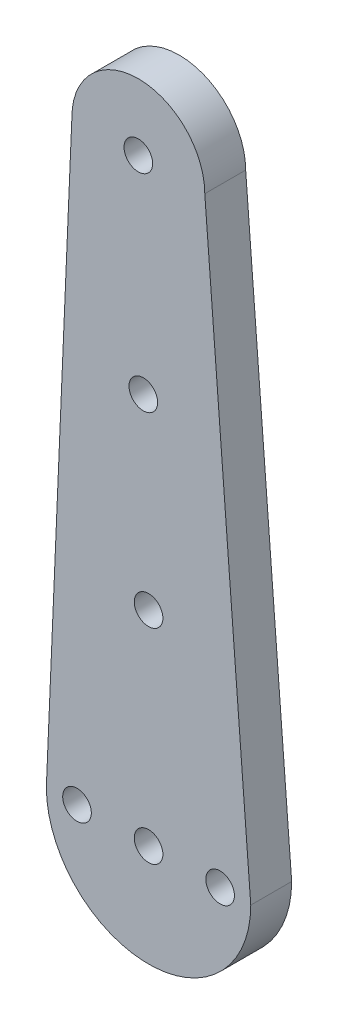
ISO-10303-21;
HEADER;
FILE_DESCRIPTION(('STEP AP214'),'2;1');
FILE_NAME('part.step','',(''),(''),'','','');
FILE_SCHEMA(('AUTOMOTIVE_DESIGN { 1 0 10303 214 1 1 1 1 }'));
ENDSEC;
DATA;
#1=APPLICATION_CONTEXT('core data for automotive mechanical design processes');
#2=APPLICATION_PROTOCOL_DEFINITION('international standard','automotive_design',2000,#1);
#3=PRODUCT_CONTEXT('',#1,'mechanical');
#4=PRODUCT('Part','Part','',(#3));
#5=PRODUCT_RELATED_PRODUCT_CATEGORY('part','',(#4));
#6=PRODUCT_DEFINITION_FORMATION('','',#4);
#7=PRODUCT_DEFINITION_CONTEXT('part definition',#1,'design');
#8=PRODUCT_DEFINITION('design','',#6,#7);
#9=PRODUCT_DEFINITION_SHAPE('','',#8);
#10=(LENGTH_UNIT() NAMED_UNIT(*) SI_UNIT(.MILLI.,.METRE.));
#11=(NAMED_UNIT(*) PLANE_ANGLE_UNIT() SI_UNIT($,.RADIAN.));
#12=(NAMED_UNIT(*) SI_UNIT($,.STERADIAN.) SOLID_ANGLE_UNIT());
#13=UNCERTAINTY_MEASURE_WITH_UNIT(LENGTH_MEASURE(1.E-05),#10,'distance_accuracy_value','');
#14=(GEOMETRIC_REPRESENTATION_CONTEXT(3) GLOBAL_UNCERTAINTY_ASSIGNED_CONTEXT((#13)) GLOBAL_UNIT_ASSIGNED_CONTEXT((#10,
#11,#12)) REPRESENTATION_CONTEXT('',''));
#15=CARTESIAN_POINT('',(0.,0.,0.));
#16=DIRECTION('',(0.,0.,1.));
#17=DIRECTION('',(1.,0.,0.));
#18=AXIS2_PLACEMENT_3D('',#15,#16,#17);
#19=CARTESIAN_POINT('',(-15.7727249732149,0.67959198476532,4.));
#20=DIRECTION('',(0.999073065879406,-0.0430465914367724,0.));
#21=DIRECTION('',(0.0430465914367724,0.999073065879406,0.));
#22=AXIS2_PLACEMENT_3D('',#19,#20,#21);
#23=PLANE('',#22);
#24=DIRECTION('',(-0.0430465914367724,-0.999073065879406,0.));
#25=VECTOR('',#24,1.);
#26=CARTESIAN_POINT('',(-15.7727249732149,0.67959198476532,0.));
#27=LINE('',#26,#25);
#28=CARTESIAN_POINT('',(-13.0006884593808,65.0160917207258,0.));
#29=VERTEX_POINT('',#28);
#30=CARTESIAN_POINT('',(-15.500688459381,6.99331729577745,0.));
#31=VERTEX_POINT('',#30);
#32=EDGE_CURVE('E121',#29,#31,#27,.T.);
#33=ORIENTED_EDGE('',*,*,#32,.T.);
#34=DIRECTION('',(0.,0.,-1.));
#35=VECTOR('',#34,1.);
#36=CARTESIAN_POINT('',(-15.500688459381,6.99331729577745,4.));
#37=LINE('',#36,#35);
#38=CARTESIAN_POINT('',(-15.500688459381,6.99331729577745,4.));
#39=VERTEX_POINT('',#38);
#40=EDGE_CURVE('E11',#39,#31,#37,.T.);
#41=ORIENTED_EDGE('',*,*,#40,.F.);
#42=DIRECTION('',(-0.0430465914367724,-0.999073065879406,0.));
#43=VECTOR('',#42,1.);
#44=CARTESIAN_POINT('',(-15.7727249732149,0.67959198476532,4.));
#45=LINE('',#44,#43);
#46=CARTESIAN_POINT('',(-13.0006884593808,65.0160917207258,4.));
#47=VERTEX_POINT('',#46);
#48=EDGE_CURVE('E91',#47,#39,#45,.T.);
#49=ORIENTED_EDGE('',*,*,#48,.F.);
#50=DIRECTION('',(0.,0.,-1.));
#51=VECTOR('',#50,1.);
#52=CARTESIAN_POINT('',(-13.0006884593808,65.0160917207258,4.));
#53=LINE('',#52,#51);
#54=EDGE_CURVE('E117',#47,#29,#53,.T.);
#55=ORIENTED_EDGE('',*,*,#54,.T.);
#56=EDGE_LOOP('',(#33,#41,#49,#55));
#57=FACE_BOUND('',#56,.T.);
#58=ADVANCED_FACE('F38',(#57),#23,.F.);
#59=CARTESIAN_POINT('',(-5.50068845938101,6.99331729577745,4.));
#60=DIRECTION('',(0.,0.,-1.));
#61=DIRECTION('',(-1.,0.,0.));
#62=AXIS2_PLACEMENT_3D('',#59,#60,#61);
#63=CYLINDRICAL_SURFACE('',#62,10.);
#64=CARTESIAN_POINT('',(-5.50068845938101,6.99331729577745,0.));
#65=DIRECTION('',(0.,0.,1.));
#66=DIRECTION('',(1.,0.,0.));
#67=AXIS2_PLACEMENT_3D('',#64,#65,#66);
#68=CIRCLE('',#67,10.);
#69=CARTESIAN_POINT('',(4.49931154061899,6.99331729577745,0.));
#70=VERTEX_POINT('',#69);
#71=EDGE_CURVE('E95',#31,#70,#68,.T.);
#72=ORIENTED_EDGE('',*,*,#71,.T.);
#73=DIRECTION('',(0.,0.,-1.));
#74=VECTOR('',#73,1.);
#75=CARTESIAN_POINT('',(4.49931154061899,6.99331729577745,4.));
#76=LINE('',#75,#74);
#77=CARTESIAN_POINT('',(4.49931154061899,6.99331729577745,4.));
#78=VERTEX_POINT('',#77);
#79=EDGE_CURVE('E47',#78,#70,#76,.T.);
#80=ORIENTED_EDGE('',*,*,#79,.F.);
#81=CARTESIAN_POINT('',(-5.50068845938101,6.99331729577745,4.));
#82=DIRECTION('',(0.,0.,1.));
#83=DIRECTION('',(1.,0.,0.));
#84=AXIS2_PLACEMENT_3D('',#81,#82,#83);
#85=CIRCLE('',#84,10.);
#86=EDGE_CURVE('E85',#39,#78,#85,.T.);
#87=ORIENTED_EDGE('',*,*,#86,.F.);
#88=ORIENTED_EDGE('',*,*,#40,.T.);
#89=EDGE_LOOP('',(#72,#80,#87,#88));
#90=FACE_BOUND('',#89,.T.);
#91=ADVANCED_FACE('F94',(#90),#63,.T.);
#92=CARTESIAN_POINT('',(5.01153964967051,0.388673734529659,4.));
#93=DIRECTION('',(-0.997006051999467,-0.0773235557668953,0.));
#94=DIRECTION('',(0.0773235557668953,-0.997006051999467,0.));
#95=AXIS2_PLACEMENT_3D('',#92,#93,#94);
#96=PLANE('',#95);
#97=DIRECTION('',(-0.0773235557668953,0.997006051999467,0.));
#98=VECTOR('',#97,1.);
#99=CARTESIAN_POINT('',(5.01153964967051,0.388673734529659,0.));
#100=LINE('',#99,#98);
#101=CARTESIAN_POINT('',(-0.000688459380885319,65.0160917207258,0.));
#102=VERTEX_POINT('',#101);
#103=EDGE_CURVE('E72',#70,#102,#100,.T.);
#104=ORIENTED_EDGE('',*,*,#103,.T.);
#105=DIRECTION('',(0.,0.,-1.));
#106=VECTOR('',#105,1.);
#107=CARTESIAN_POINT('',(-0.000688459380885319,65.0160917207258,4.));
#108=LINE('',#107,#106);
#109=CARTESIAN_POINT('',(-0.000688459380885319,65.0160917207258,4.));
#110=VERTEX_POINT('',#109);
#111=EDGE_CURVE('E96',#110,#102,#108,.T.);
#112=ORIENTED_EDGE('',*,*,#111,.F.);
#113=DIRECTION('',(-0.0773235557668953,0.997006051999467,0.));
#114=VECTOR('',#113,1.);
#115=CARTESIAN_POINT('',(5.01153964967051,0.388673734529659,4.));
#116=LINE('',#115,#114);
#117=EDGE_CURVE('E89',#78,#110,#116,.T.);
#118=ORIENTED_EDGE('',*,*,#117,.F.);
#119=ORIENTED_EDGE('',*,*,#79,.T.);
#120=EDGE_LOOP('',(#104,#112,#118,#119));
#121=FACE_BOUND('',#120,.T.);
#122=ADVANCED_FACE('F97',(#121),#96,.F.);
#123=CARTESIAN_POINT('',(1.49931154061899,6.99331729577745,4.));
#124=DIRECTION('',(0.,0.,-1.));
#125=DIRECTION('',(-1.,0.,0.));
#126=AXIS2_PLACEMENT_3D('',#123,#124,#125);
#127=CYLINDRICAL_SURFACE('',#126,1.4);
#128=CARTESIAN_POINT('',(1.49931154061899,6.99331729577745,4.));
#129=DIRECTION('',(0.,0.,1.));
#130=DIRECTION('',(1.,0.,0.));
#131=AXIS2_PLACEMENT_3D('',#128,#129,#130);
#132=CIRCLE('',#131,1.4);
#133=CARTESIAN_POINT('',(2.89931154061899,6.99331729577745,4.));
#134=VERTEX_POINT('',#133);
#135=EDGE_CURVE('E111',#134,#134,#132,.T.);
#136=ORIENTED_EDGE('',*,*,#135,.T.);
#137=EDGE_LOOP('',(#136));
#138=FACE_BOUND('',#137,.T.);
#139=CARTESIAN_POINT('',(1.49931154061899,6.99331729577745,0.));
#140=DIRECTION('',(0.,0.,1.));
#141=DIRECTION('',(1.,0.,0.));
#142=AXIS2_PLACEMENT_3D('',#139,#140,#141);
#143=CIRCLE('',#142,1.4);
#144=CARTESIAN_POINT('',(2.89931154061899,6.99331729577745,0.));
#145=VERTEX_POINT('',#144);
#146=EDGE_CURVE('E136',#145,#145,#143,.T.);
#147=ORIENTED_EDGE('',*,*,#146,.F.);
#148=EDGE_LOOP('',(#147));
#149=FACE_BOUND('',#148,.T.);
#150=ADVANCED_FACE('F175',(#138,#149),#127,.F.);
#151=CARTESIAN_POINT('',(-6.50068845938077,65.0160917207258,4.));
#152=DIRECTION('',(0.,0.,-1.));
#153=DIRECTION('',(-1.,0.,0.));
#154=AXIS2_PLACEMENT_3D('',#151,#152,#153);
#155=CYLINDRICAL_SURFACE('',#154,1.39999999999989);
#156=CARTESIAN_POINT('',(-6.50068845938077,65.0160917207258,4.));
#157=DIRECTION('',(0.,0.,1.));
#158=DIRECTION('',(1.,0.,0.));
#159=AXIS2_PLACEMENT_3D('',#156,#157,#158);
#160=CIRCLE('',#159,1.39999999999989);
#161=CARTESIAN_POINT('',(-5.10068845938088,65.0160917207258,4.));
#162=VERTEX_POINT('',#161);
#163=EDGE_CURVE('E108',#162,#162,#160,.T.);
#164=ORIENTED_EDGE('',*,*,#163,.T.);
#165=EDGE_LOOP('',(#164));
#166=FACE_BOUND('',#165,.T.);
#167=CARTESIAN_POINT('',(-6.50068845938077,65.0160917207258,0.));
#168=DIRECTION('',(0.,0.,1.));
#169=DIRECTION('',(1.,0.,0.));
#170=AXIS2_PLACEMENT_3D('',#167,#168,#169);
#171=CIRCLE('',#170,1.39999999999989);
#172=CARTESIAN_POINT('',(-5.10068845938088,65.0160917207258,0.));
#173=VERTEX_POINT('',#172);
#174=EDGE_CURVE('E133',#173,#173,#171,.T.);
#175=ORIENTED_EDGE('',*,*,#174,.F.);
#176=EDGE_LOOP('',(#175));
#177=FACE_BOUND('',#176,.T.);
#178=ADVANCED_FACE('F185',(#166,#177),#155,.F.);
#179=CARTESIAN_POINT('',(-5.50068845938101,6.99331729577745,4.));
#180=DIRECTION('',(0.,0.,-1.));
#181=DIRECTION('',(-1.,0.,0.));
#182=AXIS2_PLACEMENT_3D('',#179,#180,#181);
#183=CYLINDRICAL_SURFACE('',#182,1.4);
#184=CARTESIAN_POINT('',(-5.50068845938101,6.99331729577745,4.));
#185=DIRECTION('',(0.,0.,1.));
#186=DIRECTION('',(1.,0.,0.));
#187=AXIS2_PLACEMENT_3D('',#184,#185,#186);
#188=CIRCLE('',#187,1.4);
#189=CARTESIAN_POINT('',(-4.10068845938101,6.99331729577745,4.));
#190=VERTEX_POINT('',#189);
#191=EDGE_CURVE('E105',#190,#190,#188,.T.);
#192=ORIENTED_EDGE('',*,*,#191,.T.);
#193=EDGE_LOOP('',(#192));
#194=FACE_BOUND('',#193,.T.);
#195=CARTESIAN_POINT('',(-5.50068845938101,6.99331729577745,0.));
#196=DIRECTION('',(0.,0.,1.));
#197=DIRECTION('',(1.,0.,0.));
#198=AXIS2_PLACEMENT_3D('',#195,#196,#197);
#199=CIRCLE('',#198,1.4);
#200=CARTESIAN_POINT('',(-4.10068845938101,6.99331729577745,0.));
#201=VERTEX_POINT('',#200);
#202=EDGE_CURVE('E130',#201,#201,#199,.T.);
#203=ORIENTED_EDGE('',*,*,#202,.F.);
#204=EDGE_LOOP('',(#203));
#205=FACE_BOUND('',#204,.T.);
#206=ADVANCED_FACE('F181',(#194,#205),#183,.F.);
#207=CARTESIAN_POINT('',(-6.01275635098238,45.0160917207258,4.));
#208=DIRECTION('',(0.,0.,-1.));
#209=DIRECTION('',(-1.,0.,0.));
#210=AXIS2_PLACEMENT_3D('',#207,#208,#209);
#211=CYLINDRICAL_SURFACE('',#210,1.4);
#212=CARTESIAN_POINT('',(-6.01275635098238,45.0160917207258,4.));
#213=DIRECTION('',(0.,0.,1.));
#214=DIRECTION('',(1.,0.,0.));
#215=AXIS2_PLACEMENT_3D('',#212,#213,#214);
#216=CIRCLE('',#215,1.4);
#217=CARTESIAN_POINT('',(-4.61275635098238,45.0160917207258,4.));
#218=VERTEX_POINT('',#217);
#219=EDGE_CURVE('E99',#218,#218,#216,.T.);
#220=ORIENTED_EDGE('',*,*,#219,.T.);
#221=EDGE_LOOP('',(#220));
#222=FACE_BOUND('',#221,.T.);
#223=CARTESIAN_POINT('',(-6.01275635098238,45.0160917207258,0.));
#224=DIRECTION('',(0.,0.,1.));
#225=DIRECTION('',(1.,0.,0.));
#226=AXIS2_PLACEMENT_3D('',#223,#224,#225);
#227=CIRCLE('',#226,1.4);
#228=CARTESIAN_POINT('',(-4.61275635098238,45.0160917207258,0.));
#229=VERTEX_POINT('',#228);
#230=EDGE_CURVE('E127',#229,#229,#227,.T.);
#231=ORIENTED_EDGE('',*,*,#230,.F.);
#232=EDGE_LOOP('',(#231));
#233=FACE_BOUND('',#232,.T.);
#234=ADVANCED_FACE('F178',(#222,#233),#211,.F.);
#235=CARTESIAN_POINT('',(-6.50068845938077,65.0160917207258,4.));
#236=DIRECTION('',(0.,0.,-1.));
#237=DIRECTION('',(-1.,0.,0.));
#238=AXIS2_PLACEMENT_3D('',#235,#236,#237);
#239=CYLINDRICAL_SURFACE('',#238,6.49999999999994);
#240=CARTESIAN_POINT('',(-6.50068845938077,65.0160917207258,0.));
#241=DIRECTION('',(0.,0.,1.));
#242=DIRECTION('',(1.,0.,0.));
#243=AXIS2_PLACEMENT_3D('',#240,#241,#242);
#244=CIRCLE('',#243,6.49999999999994);
#245=EDGE_CURVE('E78',#102,#29,#244,.T.);
#246=ORIENTED_EDGE('',*,*,#245,.T.);
#247=ORIENTED_EDGE('',*,*,#54,.F.);
#248=CARTESIAN_POINT('',(-6.50068845938077,65.0160917207258,4.));
#249=DIRECTION('',(0.,0.,1.));
#250=DIRECTION('',(1.,0.,0.));
#251=AXIS2_PLACEMENT_3D('',#248,#249,#250);
#252=CIRCLE('',#251,6.49999999999994);
#253=EDGE_CURVE('E55',#110,#47,#252,.T.);
#254=ORIENTED_EDGE('',*,*,#253,.F.);
#255=ORIENTED_EDGE('',*,*,#111,.T.);
#256=EDGE_LOOP('',(#246,#247,#254,#255));
#257=FACE_BOUND('',#256,.T.);
#258=ADVANCED_FACE('F144',(#257),#239,.T.);
#259=CARTESIAN_POINT('',(-5.50068845938101,26.9933172957774,4.));
#260=DIRECTION('',(0.,0.,-1.));
#261=DIRECTION('',(-1.,0.,0.));
#262=AXIS2_PLACEMENT_3D('',#259,#260,#261);
#263=CYLINDRICAL_SURFACE('',#262,1.4);
#264=CARTESIAN_POINT('',(-5.50068845938101,26.9933172957774,4.));
#265=DIRECTION('',(0.,0.,1.));
#266=DIRECTION('',(1.,0.,0.));
#267=AXIS2_PLACEMENT_3D('',#264,#265,#266);
#268=CIRCLE('',#267,1.4);
#269=CARTESIAN_POINT('',(-4.10068845938101,26.9933172957774,4.));
#270=VERTEX_POINT('',#269);
#271=EDGE_CURVE('E142',#270,#270,#268,.T.);
#272=ORIENTED_EDGE('',*,*,#271,.T.);
#273=EDGE_LOOP('',(#272));
#274=FACE_BOUND('',#273,.T.);
#275=CARTESIAN_POINT('',(-5.50068845938101,26.9933172957774,0.));
#276=DIRECTION('',(0.,0.,1.));
#277=DIRECTION('',(1.,0.,0.));
#278=AXIS2_PLACEMENT_3D('',#275,#276,#277);
#279=CIRCLE('',#278,1.4);
#280=CARTESIAN_POINT('',(-4.10068845938101,26.9933172957774,0.));
#281=VERTEX_POINT('',#280);
#282=EDGE_CURVE('E118',#281,#281,#279,.T.);
#283=ORIENTED_EDGE('',*,*,#282,.F.);
#284=EDGE_LOOP('',(#283));
#285=FACE_BOUND('',#284,.T.);
#286=ADVANCED_FACE('F40',(#274,#285),#263,.F.);
#287=CARTESIAN_POINT('',(-12.500688459381,6.99331729577745,4.));
#288=DIRECTION('',(0.,0.,-1.));
#289=DIRECTION('',(-1.,0.,0.));
#290=AXIS2_PLACEMENT_3D('',#287,#288,#289);
#291=CYLINDRICAL_SURFACE('',#290,1.4);
#292=CARTESIAN_POINT('',(-12.500688459381,6.99331729577745,4.));
#293=DIRECTION('',(0.,0.,1.));
#294=DIRECTION('',(1.,0.,0.));
#295=AXIS2_PLACEMENT_3D('',#292,#293,#294);
#296=CIRCLE('',#295,1.4);
#297=CARTESIAN_POINT('',(-11.100688459381,6.99331729577745,4.));
#298=VERTEX_POINT('',#297);
#299=EDGE_CURVE('E114',#298,#298,#296,.F.);
#300=ORIENTED_EDGE('',*,*,#299,.F.);
#301=EDGE_LOOP('',(#300));
#302=FACE_BOUND('',#301,.T.);
#303=CARTESIAN_POINT('',(-12.500688459381,6.99331729577745,0.));
#304=DIRECTION('',(0.,0.,1.));
#305=DIRECTION('',(1.,0.,0.));
#306=AXIS2_PLACEMENT_3D('',#303,#304,#305);
#307=CIRCLE('',#306,1.4);
#308=CARTESIAN_POINT('',(-11.100688459381,6.99331729577745,0.));
#309=VERTEX_POINT('',#308);
#310=EDGE_CURVE('E139',#309,#309,#307,.F.);
#311=ORIENTED_EDGE('',*,*,#310,.T.);
#312=EDGE_LOOP('',(#311));
#313=FACE_BOUND('',#312,.T.);
#314=ADVANCED_FACE('F157',(#302,#313),#291,.F.);
#315=CARTESIAN_POINT('',(0.,0.,4.));
#316=DIRECTION('',(0.,0.,1.));
#317=DIRECTION('',(1.,0.,0.));
#318=AXIS2_PLACEMENT_3D('',#315,#316,#317);
#319=PLANE('',#318);
#320=ORIENTED_EDGE('',*,*,#271,.F.);
#321=EDGE_LOOP('',(#320));
#322=FACE_BOUND('',#321,.T.);
#323=ORIENTED_EDGE('',*,*,#48,.T.);
#324=ORIENTED_EDGE('',*,*,#86,.T.);
#325=ORIENTED_EDGE('',*,*,#117,.T.);
#326=ORIENTED_EDGE('',*,*,#253,.T.);
#327=EDGE_LOOP('',(#323,#324,#325,#326));
#328=FACE_BOUND('',#327,.T.);
#329=ORIENTED_EDGE('',*,*,#219,.F.);
#330=EDGE_LOOP('',(#329));
#331=FACE_BOUND('',#330,.T.);
#332=ORIENTED_EDGE('',*,*,#191,.F.);
#333=EDGE_LOOP('',(#332));
#334=FACE_BOUND('',#333,.T.);
#335=ORIENTED_EDGE('',*,*,#163,.F.);
#336=EDGE_LOOP('',(#335));
#337=FACE_BOUND('',#336,.T.);
#338=ORIENTED_EDGE('',*,*,#135,.F.);
#339=EDGE_LOOP('',(#338));
#340=FACE_BOUND('',#339,.T.);
#341=ORIENTED_EDGE('',*,*,#299,.T.);
#342=EDGE_LOOP('',(#341));
#343=FACE_BOUND('',#342,.T.);
#344=ADVANCED_FACE('F86',(#322,#328,#331,#334,#337,#340,#343),#319,.T.);
#345=CARTESIAN_POINT('',(0.,0.,0.));
#346=DIRECTION('',(0.,0.,1.));
#347=DIRECTION('',(1.,0.,0.));
#348=AXIS2_PLACEMENT_3D('',#345,#346,#347);
#349=PLANE('',#348);
#350=ORIENTED_EDGE('',*,*,#282,.T.);
#351=EDGE_LOOP('',(#350));
#352=FACE_BOUND('',#351,.T.);
#353=ORIENTED_EDGE('',*,*,#32,.F.);
#354=ORIENTED_EDGE('',*,*,#245,.F.);
#355=ORIENTED_EDGE('',*,*,#103,.F.);
#356=ORIENTED_EDGE('',*,*,#71,.F.);
#357=EDGE_LOOP('',(#353,#354,#355,#356));
#358=FACE_BOUND('',#357,.T.);
#359=ORIENTED_EDGE('',*,*,#230,.T.);
#360=EDGE_LOOP('',(#359));
#361=FACE_BOUND('',#360,.T.);
#362=ORIENTED_EDGE('',*,*,#202,.T.);
#363=EDGE_LOOP('',(#362));
#364=FACE_BOUND('',#363,.T.);
#365=ORIENTED_EDGE('',*,*,#174,.T.);
#366=EDGE_LOOP('',(#365));
#367=FACE_BOUND('',#366,.T.);
#368=ORIENTED_EDGE('',*,*,#146,.T.);
#369=EDGE_LOOP('',(#368));
#370=FACE_BOUND('',#369,.T.);
#371=ORIENTED_EDGE('',*,*,#310,.F.);
#372=EDGE_LOOP('',(#371));
#373=FACE_BOUND('',#372,.T.);
#374=ADVANCED_FACE('F147',(#352,#358,#361,#364,#367,#370,#373),#349,.F.);
#375=CLOSED_SHELL('',(#58,#91,#122,#150,#178,#206,#234,#258,#286,#314,#344,#374));
#376=MANIFOLD_SOLID_BREP('B2',#375);
#377=ADVANCED_BREP_SHAPE_REPRESENTATION('',(#18,#376),#14);
#378=SHAPE_DEFINITION_REPRESENTATION(#9,#377);
ENDSEC;
END-ISO-10303-21;
